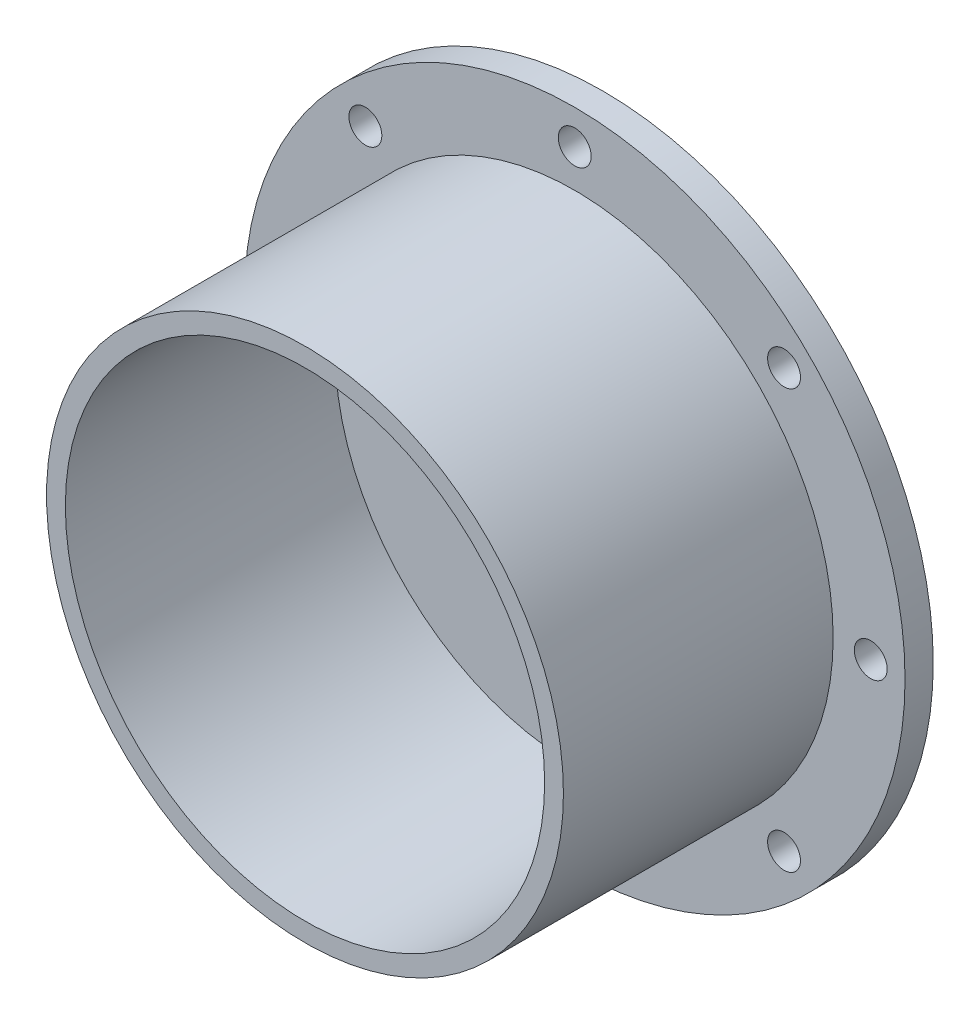
ISO-10303-21;
HEADER;
FILE_DESCRIPTION(('STEP AP214'),'2;1');
FILE_NAME('part.step','',(''),(''),'','','');
FILE_SCHEMA(('AUTOMOTIVE_DESIGN { 1 0 10303 214 1 1 1 1 }'));
ENDSEC;
DATA;
#1=APPLICATION_CONTEXT('core data for automotive mechanical design processes');
#2=APPLICATION_PROTOCOL_DEFINITION('international standard','automotive_design',2000,#1);
#3=PRODUCT_CONTEXT('',#1,'mechanical');
#4=PRODUCT('Part','Part','',(#3));
#5=PRODUCT_RELATED_PRODUCT_CATEGORY('part','',(#4));
#6=PRODUCT_DEFINITION_FORMATION('','',#4);
#7=PRODUCT_DEFINITION_CONTEXT('part definition',#1,'design');
#8=PRODUCT_DEFINITION('design','',#6,#7);
#9=PRODUCT_DEFINITION_SHAPE('','',#8);
#10=(LENGTH_UNIT() NAMED_UNIT(*) SI_UNIT(.MILLI.,.METRE.));
#11=(NAMED_UNIT(*) PLANE_ANGLE_UNIT() SI_UNIT($,.RADIAN.));
#12=(NAMED_UNIT(*) SI_UNIT($,.STERADIAN.) SOLID_ANGLE_UNIT());
#13=UNCERTAINTY_MEASURE_WITH_UNIT(LENGTH_MEASURE(1.E-05),#10,'distance_accuracy_value','');
#14=(GEOMETRIC_REPRESENTATION_CONTEXT(3) GLOBAL_UNCERTAINTY_ASSIGNED_CONTEXT((#13)) GLOBAL_UNIT_ASSIGNED_CONTEXT((#10,
#11,#12)) REPRESENTATION_CONTEXT('',''));
#15=CARTESIAN_POINT('',(0.,0.,0.));
#16=DIRECTION('',(0.,0.,1.));
#17=DIRECTION('',(1.,0.,0.));
#18=AXIS2_PLACEMENT_3D('',#15,#16,#17);
#19=CARTESIAN_POINT('',(0.,0.,3.));
#20=DIRECTION('',(0.,0.,1.));
#21=DIRECTION('',(1.,0.,0.));
#22=AXIS2_PLACEMENT_3D('',#19,#20,#21);
#23=PLANE('',#22);
#24=CARTESIAN_POINT('',(0.,0.,3.));
#25=DIRECTION('',(0.,0.,1.));
#26=DIRECTION('',(1.,0.,0.));
#27=AXIS2_PLACEMENT_3D('',#24,#25,#26);
#28=CIRCLE('',#27,27.5);
#29=CARTESIAN_POINT('',(27.5,0.,3.));
#30=VERTEX_POINT('',#29);
#31=EDGE_CURVE('E122',#30,#30,#28,.T.);
#32=ORIENTED_EDGE('',*,*,#31,.F.);
#33=EDGE_LOOP('',(#32));
#34=FACE_BOUND('',#33,.T.);
#35=CARTESIAN_POINT('',(-31.4999999999987,-1.34292577058659E-12,3.));
#36=DIRECTION('',(0.,0.,1.));
#37=DIRECTION('',(1.,0.,0.));
#38=AXIS2_PLACEMENT_3D('',#35,#36,#37);
#39=CIRCLE('',#38,1.75000000000199);
#40=CARTESIAN_POINT('',(-29.7499999999967,-1.34292577058659E-12,3.));
#41=VERTEX_POINT('',#40);
#42=EDGE_CURVE('E102',#41,#41,#39,.T.);
#43=ORIENTED_EDGE('',*,*,#42,.F.);
#44=EDGE_LOOP('',(#43));
#45=FACE_BOUND('',#44,.T.);
#46=CARTESIAN_POINT('',(2.67813626633855E-12,-31.5,3.));
#47=DIRECTION('',(0.,0.,1.));
#48=DIRECTION('',(1.,0.,0.));
#49=AXIS2_PLACEMENT_3D('',#46,#47,#48);
#50=CIRCLE('',#49,1.75000000000277);
#51=CARTESIAN_POINT('',(1.75000000000545,-31.5,3.));
#52=VERTEX_POINT('',#51);
#53=EDGE_CURVE('E86',#52,#52,#50,.T.);
#54=ORIENTED_EDGE('',*,*,#53,.F.);
#55=EDGE_LOOP('',(#54));
#56=FACE_BOUND('',#55,.T.);
#57=CARTESIAN_POINT('',(31.5000000000013,1.33906813316928E-12,3.));
#58=DIRECTION('',(0.,0.,1.));
#59=DIRECTION('',(1.,0.,0.));
#60=AXIS2_PLACEMENT_3D('',#57,#58,#59);
#61=CIRCLE('',#60,1.75000000000099);
#62=CARTESIAN_POINT('',(33.2500000000023,1.33906813316928E-12,3.));
#63=VERTEX_POINT('',#62);
#64=EDGE_CURVE('E70',#63,#63,#61,.T.);
#65=ORIENTED_EDGE('',*,*,#64,.F.);
#66=EDGE_LOOP('',(#65));
#67=FACE_BOUND('',#66,.T.);
#68=CARTESIAN_POINT('',(0.,31.5,3.));
#69=DIRECTION('',(0.,0.,1.));
#70=DIRECTION('',(1.,0.,0.));
#71=AXIS2_PLACEMENT_3D('',#68,#69,#70);
#72=CIRCLE('',#71,1.75);
#73=CARTESIAN_POINT('',(1.75,31.5,3.));
#74=VERTEX_POINT('',#73);
#75=EDGE_CURVE('E56',#74,#74,#72,.T.);
#76=ORIENTED_EDGE('',*,*,#75,.F.);
#77=EDGE_LOOP('',(#76));
#78=FACE_BOUND('',#77,.T.);
#79=CARTESIAN_POINT('',(0.,0.,3.));
#80=DIRECTION('',(0.,0.,1.));
#81=DIRECTION('',(1.,0.,0.));
#82=AXIS2_PLACEMENT_3D('',#79,#80,#81);
#83=CIRCLE('',#82,35.15);
#84=CARTESIAN_POINT('',(35.15,0.,3.));
#85=VERTEX_POINT('',#84);
#86=EDGE_CURVE('E45',#85,#85,#83,.T.);
#87=ORIENTED_EDGE('',*,*,#86,.T.);
#88=EDGE_LOOP('',(#87));
#89=FACE_BOUND('',#88,.T.);
#90=CARTESIAN_POINT('',(22.2738636073766,22.2738636073772,3.));
#91=DIRECTION('',(0.,0.,1.));
#92=DIRECTION('',(1.,0.,0.));
#93=AXIS2_PLACEMENT_3D('',#90,#91,#92);
#94=CIRCLE('',#93,1.75000000000016);
#95=CARTESIAN_POINT('',(24.0238636073768,22.2738636073772,3.));
#96=VERTEX_POINT('',#95);
#97=EDGE_CURVE('E62',#96,#96,#94,.T.);
#98=ORIENTED_EDGE('',*,*,#97,.F.);
#99=EDGE_LOOP('',(#98));
#100=FACE_BOUND('',#99,.T.);
#101=CARTESIAN_POINT('',(22.2738636073785,-22.2738636073753,3.));
#102=DIRECTION('',(0.,0.,1.));
#103=DIRECTION('',(1.,0.,0.));
#104=AXIS2_PLACEMENT_3D('',#101,#102,#103);
#105=CIRCLE('',#104,1.75000000000207);
#106=CARTESIAN_POINT('',(24.0238636073806,-22.2738636073753,3.));
#107=VERTEX_POINT('',#106);
#108=EDGE_CURVE('E78',#107,#107,#105,.T.);
#109=ORIENTED_EDGE('',*,*,#108,.F.);
#110=EDGE_LOOP('',(#109));
#111=FACE_BOUND('',#110,.T.);
#112=CARTESIAN_POINT('',(-22.273863607374,-22.2738636073772,3.));
#113=DIRECTION('',(0.,0.,1.));
#114=DIRECTION('',(1.,0.,0.));
#115=AXIS2_PLACEMENT_3D('',#112,#113,#114);
#116=CIRCLE('',#115,1.75000000000272);
#117=CARTESIAN_POINT('',(-20.5238636073712,-22.2738636073772,3.));
#118=VERTEX_POINT('',#117);
#119=EDGE_CURVE('E94',#118,#118,#116,.T.);
#120=ORIENTED_EDGE('',*,*,#119,.F.);
#121=EDGE_LOOP('',(#120));
#122=FACE_BOUND('',#121,.T.);
#123=CARTESIAN_POINT('',(-22.2738636073759,22.2738636073753,3.));
#124=DIRECTION('',(0.,0.,1.));
#125=DIRECTION('',(1.,0.,0.));
#126=AXIS2_PLACEMENT_3D('',#123,#124,#125);
#127=CIRCLE('',#126,1.75000000000103);
#128=CARTESIAN_POINT('',(-20.5238636073748,22.2738636073753,3.));
#129=VERTEX_POINT('',#128);
#130=EDGE_CURVE('E110',#129,#129,#127,.T.);
#131=ORIENTED_EDGE('',*,*,#130,.F.);
#132=EDGE_LOOP('',(#131));
#133=FACE_BOUND('',#132,.T.);
#134=ADVANCED_FACE('F37',(#34,#45,#56,#67,#78,#89,#100,#111,#122,#133),#23,.T.);
#135=CARTESIAN_POINT('',(0.,0.,0.));
#136=DIRECTION('',(0.,0.,1.));
#137=DIRECTION('',(1.,0.,0.));
#138=AXIS2_PLACEMENT_3D('',#135,#136,#137);
#139=PLANE('',#138);
#140=CARTESIAN_POINT('',(0.,0.,0.));
#141=DIRECTION('',(0.,0.,1.));
#142=DIRECTION('',(1.,0.,0.));
#143=AXIS2_PLACEMENT_3D('',#140,#141,#142);
#144=CIRCLE('',#143,35.15);
#145=CARTESIAN_POINT('',(35.15,0.,0.));
#146=VERTEX_POINT('',#145);
#147=EDGE_CURVE('E50',#146,#146,#144,.T.);
#148=ORIENTED_EDGE('',*,*,#147,.F.);
#149=EDGE_LOOP('',(#148));
#150=FACE_BOUND('',#149,.T.);
#151=CARTESIAN_POINT('',(0.,31.5,0.));
#152=DIRECTION('',(0.,0.,1.));
#153=DIRECTION('',(1.,0.,0.));
#154=AXIS2_PLACEMENT_3D('',#151,#152,#153);
#155=CIRCLE('',#154,1.75);
#156=CARTESIAN_POINT('',(1.75,31.5,0.));
#157=VERTEX_POINT('',#156);
#158=EDGE_CURVE('E58',#157,#157,#155,.T.);
#159=ORIENTED_EDGE('',*,*,#158,.T.);
#160=EDGE_LOOP('',(#159));
#161=FACE_BOUND('',#160,.T.);
#162=CARTESIAN_POINT('',(22.2738636073766,22.2738636073772,0.));
#163=DIRECTION('',(0.,0.,1.));
#164=DIRECTION('',(1.,0.,0.));
#165=AXIS2_PLACEMENT_3D('',#162,#163,#164);
#166=CIRCLE('',#165,1.75000000000016);
#167=CARTESIAN_POINT('',(24.0238636073768,22.2738636073772,0.));
#168=VERTEX_POINT('',#167);
#169=EDGE_CURVE('E66',#168,#168,#166,.T.);
#170=ORIENTED_EDGE('',*,*,#169,.T.);
#171=EDGE_LOOP('',(#170));
#172=FACE_BOUND('',#171,.T.);
#173=CARTESIAN_POINT('',(31.5000000000013,1.33906813316928E-12,0.));
#174=DIRECTION('',(0.,0.,1.));
#175=DIRECTION('',(1.,0.,0.));
#176=AXIS2_PLACEMENT_3D('',#173,#174,#175);
#177=CIRCLE('',#176,1.75000000000099);
#178=CARTESIAN_POINT('',(33.2500000000023,1.33906813316928E-12,0.));
#179=VERTEX_POINT('',#178);
#180=EDGE_CURVE('E74',#179,#179,#177,.T.);
#181=ORIENTED_EDGE('',*,*,#180,.T.);
#182=EDGE_LOOP('',(#181));
#183=FACE_BOUND('',#182,.T.);
#184=CARTESIAN_POINT('',(22.2738636073785,-22.2738636073753,0.));
#185=DIRECTION('',(0.,0.,1.));
#186=DIRECTION('',(1.,0.,0.));
#187=AXIS2_PLACEMENT_3D('',#184,#185,#186);
#188=CIRCLE('',#187,1.75000000000207);
#189=CARTESIAN_POINT('',(24.0238636073806,-22.2738636073753,0.));
#190=VERTEX_POINT('',#189);
#191=EDGE_CURVE('E82',#190,#190,#188,.T.);
#192=ORIENTED_EDGE('',*,*,#191,.T.);
#193=EDGE_LOOP('',(#192));
#194=FACE_BOUND('',#193,.T.);
#195=CARTESIAN_POINT('',(2.67813626633855E-12,-31.5,0.));
#196=DIRECTION('',(0.,0.,1.));
#197=DIRECTION('',(1.,0.,0.));
#198=AXIS2_PLACEMENT_3D('',#195,#196,#197);
#199=CIRCLE('',#198,1.75000000000277);
#200=CARTESIAN_POINT('',(1.75000000000545,-31.5,0.));
#201=VERTEX_POINT('',#200);
#202=EDGE_CURVE('E90',#201,#201,#199,.T.);
#203=ORIENTED_EDGE('',*,*,#202,.T.);
#204=EDGE_LOOP('',(#203));
#205=FACE_BOUND('',#204,.T.);
#206=CARTESIAN_POINT('',(-22.273863607374,-22.2738636073772,0.));
#207=DIRECTION('',(0.,0.,1.));
#208=DIRECTION('',(1.,0.,0.));
#209=AXIS2_PLACEMENT_3D('',#206,#207,#208);
#210=CIRCLE('',#209,1.75000000000272);
#211=CARTESIAN_POINT('',(-20.5238636073712,-22.2738636073772,0.));
#212=VERTEX_POINT('',#211);
#213=EDGE_CURVE('E98',#212,#212,#210,.T.);
#214=ORIENTED_EDGE('',*,*,#213,.T.);
#215=EDGE_LOOP('',(#214));
#216=FACE_BOUND('',#215,.T.);
#217=CARTESIAN_POINT('',(-31.4999999999987,-1.34292577058659E-12,0.));
#218=DIRECTION('',(0.,0.,1.));
#219=DIRECTION('',(1.,0.,0.));
#220=AXIS2_PLACEMENT_3D('',#217,#218,#219);
#221=CIRCLE('',#220,1.75000000000199);
#222=CARTESIAN_POINT('',(-29.7499999999967,-1.34292577058659E-12,0.));
#223=VERTEX_POINT('',#222);
#224=EDGE_CURVE('E106',#223,#223,#221,.T.);
#225=ORIENTED_EDGE('',*,*,#224,.T.);
#226=EDGE_LOOP('',(#225));
#227=FACE_BOUND('',#226,.T.);
#228=CARTESIAN_POINT('',(-22.2738636073759,22.2738636073753,0.));
#229=DIRECTION('',(0.,0.,1.));
#230=DIRECTION('',(1.,0.,0.));
#231=AXIS2_PLACEMENT_3D('',#228,#229,#230);
#232=CIRCLE('',#231,1.75000000000103);
#233=CARTESIAN_POINT('',(-20.5238636073748,22.2738636073753,0.));
#234=VERTEX_POINT('',#233);
#235=EDGE_CURVE('E114',#234,#234,#232,.T.);
#236=ORIENTED_EDGE('',*,*,#235,.T.);
#237=EDGE_LOOP('',(#236));
#238=FACE_BOUND('',#237,.T.);
#239=ADVANCED_FACE('F153',(#150,#161,#172,#183,#194,#205,#216,#227,#238),#139,.F.);
#240=CARTESIAN_POINT('',(0.,0.,3.));
#241=DIRECTION('',(0.,0.,-1.));
#242=DIRECTION('',(-1.,0.,0.));
#243=AXIS2_PLACEMENT_3D('',#240,#241,#242);
#244=CYLINDRICAL_SURFACE('',#243,35.15);
#245=ORIENTED_EDGE('',*,*,#86,.F.);
#246=EDGE_LOOP('',(#245));
#247=FACE_BOUND('',#246,.T.);
#248=ORIENTED_EDGE('',*,*,#147,.T.);
#249=EDGE_LOOP('',(#248));
#250=FACE_BOUND('',#249,.T.);
#251=ADVANCED_FACE('F39',(#247,#250),#244,.T.);
#252=CARTESIAN_POINT('',(0.,31.5,3.));
#253=DIRECTION('',(0.,0.,-1.));
#254=DIRECTION('',(-1.,0.,0.));
#255=AXIS2_PLACEMENT_3D('',#252,#253,#254);
#256=CYLINDRICAL_SURFACE('',#255,1.75);
#257=ORIENTED_EDGE('',*,*,#75,.T.);
#258=EDGE_LOOP('',(#257));
#259=FACE_BOUND('',#258,.T.);
#260=ORIENTED_EDGE('',*,*,#158,.F.);
#261=EDGE_LOOP('',(#260));
#262=FACE_BOUND('',#261,.T.);
#263=ADVANCED_FACE('F250',(#259,#262),#256,.F.);
#264=CARTESIAN_POINT('',(22.2738636073766,22.2738636073772,3.));
#265=DIRECTION('',(0.,0.,-1.));
#266=DIRECTION('',(-1.,0.,0.));
#267=AXIS2_PLACEMENT_3D('',#264,#265,#266);
#268=CYLINDRICAL_SURFACE('',#267,1.75000000000016);
#269=ORIENTED_EDGE('',*,*,#97,.T.);
#270=EDGE_LOOP('',(#269));
#271=FACE_BOUND('',#270,.T.);
#272=ORIENTED_EDGE('',*,*,#169,.F.);
#273=EDGE_LOOP('',(#272));
#274=FACE_BOUND('',#273,.T.);
#275=ADVANCED_FACE('F240',(#271,#274),#268,.F.);
#276=CARTESIAN_POINT('',(31.5000000000013,1.33906813316928E-12,3.));
#277=DIRECTION('',(0.,0.,-1.));
#278=DIRECTION('',(-1.,0.,0.));
#279=AXIS2_PLACEMENT_3D('',#276,#277,#278);
#280=CYLINDRICAL_SURFACE('',#279,1.75000000000099);
#281=ORIENTED_EDGE('',*,*,#64,.T.);
#282=EDGE_LOOP('',(#281));
#283=FACE_BOUND('',#282,.T.);
#284=ORIENTED_EDGE('',*,*,#180,.F.);
#285=EDGE_LOOP('',(#284));
#286=FACE_BOUND('',#285,.T.);
#287=ADVANCED_FACE('F230',(#283,#286),#280,.F.);
#288=CARTESIAN_POINT('',(22.2738636073785,-22.2738636073753,3.));
#289=DIRECTION('',(0.,0.,-1.));
#290=DIRECTION('',(-1.,0.,0.));
#291=AXIS2_PLACEMENT_3D('',#288,#289,#290);
#292=CYLINDRICAL_SURFACE('',#291,1.75000000000207);
#293=ORIENTED_EDGE('',*,*,#108,.T.);
#294=EDGE_LOOP('',(#293));
#295=FACE_BOUND('',#294,.T.);
#296=ORIENTED_EDGE('',*,*,#191,.F.);
#297=EDGE_LOOP('',(#296));
#298=FACE_BOUND('',#297,.T.);
#299=ADVANCED_FACE('F220',(#295,#298),#292,.F.);
#300=CARTESIAN_POINT('',(2.67813626633855E-12,-31.5,3.));
#301=DIRECTION('',(0.,0.,-1.));
#302=DIRECTION('',(-1.,0.,0.));
#303=AXIS2_PLACEMENT_3D('',#300,#301,#302);
#304=CYLINDRICAL_SURFACE('',#303,1.75000000000277);
#305=ORIENTED_EDGE('',*,*,#53,.T.);
#306=EDGE_LOOP('',(#305));
#307=FACE_BOUND('',#306,.T.);
#308=ORIENTED_EDGE('',*,*,#202,.F.);
#309=EDGE_LOOP('',(#308));
#310=FACE_BOUND('',#309,.T.);
#311=ADVANCED_FACE('F210',(#307,#310),#304,.F.);
#312=CARTESIAN_POINT('',(-22.273863607374,-22.2738636073772,3.));
#313=DIRECTION('',(0.,0.,-1.));
#314=DIRECTION('',(-1.,0.,0.));
#315=AXIS2_PLACEMENT_3D('',#312,#313,#314);
#316=CYLINDRICAL_SURFACE('',#315,1.75000000000272);
#317=ORIENTED_EDGE('',*,*,#119,.T.);
#318=EDGE_LOOP('',(#317));
#319=FACE_BOUND('',#318,.T.);
#320=ORIENTED_EDGE('',*,*,#213,.F.);
#321=EDGE_LOOP('',(#320));
#322=FACE_BOUND('',#321,.T.);
#323=ADVANCED_FACE('F200',(#319,#322),#316,.F.);
#324=CARTESIAN_POINT('',(-31.4999999999987,-1.34292577058659E-12,3.));
#325=DIRECTION('',(0.,0.,-1.));
#326=DIRECTION('',(-1.,0.,0.));
#327=AXIS2_PLACEMENT_3D('',#324,#325,#326);
#328=CYLINDRICAL_SURFACE('',#327,1.75000000000199);
#329=ORIENTED_EDGE('',*,*,#42,.T.);
#330=EDGE_LOOP('',(#329));
#331=FACE_BOUND('',#330,.T.);
#332=ORIENTED_EDGE('',*,*,#224,.F.);
#333=EDGE_LOOP('',(#332));
#334=FACE_BOUND('',#333,.T.);
#335=ADVANCED_FACE('F148',(#331,#334),#328,.F.);
#336=CARTESIAN_POINT('',(-22.2738636073759,22.2738636073753,3.));
#337=DIRECTION('',(0.,0.,-1.));
#338=DIRECTION('',(-1.,0.,0.));
#339=AXIS2_PLACEMENT_3D('',#336,#337,#338);
#340=CYLINDRICAL_SURFACE('',#339,1.75000000000103);
#341=ORIENTED_EDGE('',*,*,#130,.T.);
#342=EDGE_LOOP('',(#341));
#343=FACE_BOUND('',#342,.T.);
#344=ORIENTED_EDGE('',*,*,#235,.F.);
#345=EDGE_LOOP('',(#344));
#346=FACE_BOUND('',#345,.T.);
#347=ADVANCED_FACE('F139',(#343,#346),#340,.F.);
#348=CARTESIAN_POINT('',(0.,0.,31.7));
#349=DIRECTION('',(0.,0.,1.));
#350=DIRECTION('',(1.,0.,0.));
#351=AXIS2_PLACEMENT_3D('',#348,#349,#350);
#352=PLANE('',#351);
#353=CARTESIAN_POINT('',(0.,0.,31.7));
#354=DIRECTION('',(0.,0.,1.));
#355=DIRECTION('',(1.,0.,0.));
#356=AXIS2_PLACEMENT_3D('',#353,#354,#355);
#357=CIRCLE('',#356,27.5);
#358=CARTESIAN_POINT('',(27.5,0.,31.7));
#359=VERTEX_POINT('',#358);
#360=EDGE_CURVE('E118',#359,#359,#357,.T.);
#361=ORIENTED_EDGE('',*,*,#360,.T.);
#362=EDGE_LOOP('',(#361));
#363=FACE_BOUND('',#362,.T.);
#364=CARTESIAN_POINT('',(0.,0.,31.7));
#365=DIRECTION('',(0.,0.,1.));
#366=DIRECTION('',(1.,0.,0.));
#367=AXIS2_PLACEMENT_3D('',#364,#365,#366);
#368=CIRCLE('',#367,25.5);
#369=CARTESIAN_POINT('',(25.5,0.,31.7));
#370=VERTEX_POINT('',#369);
#371=EDGE_CURVE('E126',#370,#370,#368,.T.);
#372=ORIENTED_EDGE('',*,*,#371,.F.);
#373=EDGE_LOOP('',(#372));
#374=FACE_BOUND('',#373,.T.);
#375=ADVANCED_FACE('F136',(#363,#374),#352,.T.);
#376=CARTESIAN_POINT('',(0.,0.,31.7));
#377=DIRECTION('',(0.,0.,-1.));
#378=DIRECTION('',(-1.,0.,0.));
#379=AXIS2_PLACEMENT_3D('',#376,#377,#378);
#380=CYLINDRICAL_SURFACE('',#379,27.5);
#381=ORIENTED_EDGE('',*,*,#360,.F.);
#382=EDGE_LOOP('',(#381));
#383=FACE_BOUND('',#382,.T.);
#384=ORIENTED_EDGE('',*,*,#31,.T.);
#385=EDGE_LOOP('',(#384));
#386=FACE_BOUND('',#385,.T.);
#387=ADVANCED_FACE('F138',(#383,#386),#380,.T.);
#388=CARTESIAN_POINT('',(0.,0.,31.7));
#389=DIRECTION('',(0.,0.,-1.));
#390=DIRECTION('',(-1.,0.,0.));
#391=AXIS2_PLACEMENT_3D('',#388,#389,#390);
#392=CYLINDRICAL_SURFACE('',#391,25.5);
#393=ORIENTED_EDGE('',*,*,#371,.T.);
#394=EDGE_LOOP('',(#393));
#395=FACE_BOUND('',#394,.T.);
#396=CARTESIAN_POINT('',(0.,0.,3.));
#397=DIRECTION('',(0.,0.,1.));
#398=DIRECTION('',(1.,0.,0.));
#399=AXIS2_PLACEMENT_3D('',#396,#397,#398);
#400=CIRCLE('',#399,25.5);
#401=CARTESIAN_POINT('',(25.5,0.,3.));
#402=VERTEX_POINT('',#401);
#403=EDGE_CURVE('E10',#402,#402,#400,.F.);
#404=ORIENTED_EDGE('',*,*,#403,.T.);
#405=EDGE_LOOP('',(#404));
#406=FACE_BOUND('',#405,.T.);
#407=ADVANCED_FACE('F134',(#395,#406),#392,.F.);
#408=ORIENTED_EDGE('',*,*,#403,.F.);
#409=EDGE_LOOP('',(#408));
#410=FACE_BOUND('',#409,.T.);
#411=ADVANCED_FACE('F156',(#410),#23,.T.);
#412=CLOSED_SHELL('',(#134,#239,#251,#263,#275,#287,#299,#311,#323,#335,#347,#375,#387,#407,#411));
#413=MANIFOLD_SOLID_BREP('B2',#412);
#414=ADVANCED_BREP_SHAPE_REPRESENTATION('',(#18,#413),#14);
#415=SHAPE_DEFINITION_REPRESENTATION(#9,#414);
ENDSEC;
END-ISO-10303-21;
